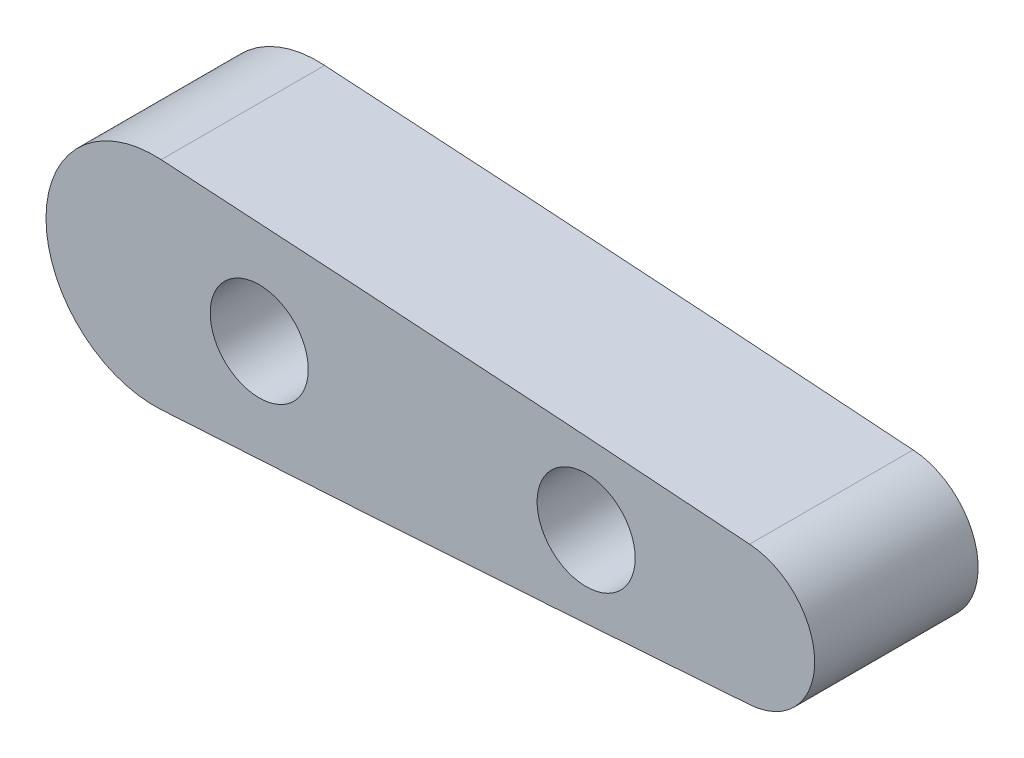
ISO-10303-21;
HEADER;
FILE_DESCRIPTION(('STEP AP214'),'2;1');
FILE_NAME('part.step','',(''),(''),'','','');
FILE_SCHEMA(('AUTOMOTIVE_DESIGN { 1 0 10303 214 1 1 1 1 }'));
ENDSEC;
DATA;
#1=APPLICATION_CONTEXT('core data for automotive mechanical design processes');
#2=APPLICATION_PROTOCOL_DEFINITION('international standard','automotive_design',2000,#1);
#3=PRODUCT_CONTEXT('',#1,'mechanical');
#4=PRODUCT('Part','Part','',(#3));
#5=PRODUCT_RELATED_PRODUCT_CATEGORY('part','',(#4));
#6=PRODUCT_DEFINITION_FORMATION('','',#4);
#7=PRODUCT_DEFINITION_CONTEXT('part definition',#1,'design');
#8=PRODUCT_DEFINITION('design','',#6,#7);
#9=PRODUCT_DEFINITION_SHAPE('','',#8);
#10=(LENGTH_UNIT() NAMED_UNIT(*) SI_UNIT(.MILLI.,.METRE.));
#11=(NAMED_UNIT(*) PLANE_ANGLE_UNIT() SI_UNIT($,.RADIAN.));
#12=(NAMED_UNIT(*) SI_UNIT($,.STERADIAN.) SOLID_ANGLE_UNIT());
#13=UNCERTAINTY_MEASURE_WITH_UNIT(LENGTH_MEASURE(1.E-05),#10,'distance_accuracy_value','');
#14=(GEOMETRIC_REPRESENTATION_CONTEXT(3) GLOBAL_UNCERTAINTY_ASSIGNED_CONTEXT((#13)) GLOBAL_UNIT_ASSIGNED_CONTEXT((#10,
#11,#12)) REPRESENTATION_CONTEXT('',''));
#15=CARTESIAN_POINT('',(0.,0.,0.));
#16=DIRECTION('',(0.,0.,1.));
#17=DIRECTION('',(1.,0.,0.));
#18=AXIS2_PLACEMENT_3D('',#15,#16,#17);
#19=CARTESIAN_POINT('',(106.499999999986,2.08799721122081,-82.8566204933771));
#20=CARTESIAN_POINT('',(104.913139889866,2.20366666564661,-82.8566204933771));
#21=CARTESIAN_POINT('',(102.105909691164,2.40304973466525,-82.8566204933771));
#22=CARTESIAN_POINT('',(98.0776680138944,2.67654836965966,-82.8566204933771));
#23=CARTESIAN_POINT('',(94.4157189816286,2.91456727593299,-82.8566204933771));
#24=CARTESIAN_POINT('',(91.2230954471117,3.11281194720779,-82.8566204933771));
#25=CARTESIAN_POINT('',(89.251038129504,3.23017110293967,-82.8566204933771));
#26=CARTESIAN_POINT('',(88.5,3.2740978712495,-82.8566204933771));
#27=B_SPLINE_CURVE_WITH_KNOTS('',3,(#19,#20,#21,#22,#23,#24,#25,#26),.UNSPECIFIED.,.F.,.F.,(4,1,
1,1,1,4),(0.104547089861926,0.124845726031854,0.140451441785836,0.156057157539818,
0.1716628732938,0.181260887125618),.UNSPECIFIED.);
#28=DIRECTION('',(0.,0.,1.));
#29=VECTOR('',#28,1.);
#30=SURFACE_OF_LINEAR_EXTRUSION('',#27,#29);
#31=CARTESIAN_POINT('',(87.6352127081631,3.32433643264375,-77.8566204933771));
#32=CARTESIAN_POINT('',(88.4113691729223,3.27955889680447,-77.8566204933771));
#33=CARTESIAN_POINT('',(89.1874771905029,3.2339446716543,-77.8566204933771));
#34=CARTESIAN_POINT('',(90.7396110024664,3.14112250056433,-77.8566204933771));
#35=CARTESIAN_POINT('',(91.5156367952523,3.09391452791605,-77.8566204933771));
#36=CARTESIAN_POINT('',(93.0676058131194,2.99798534597182,-77.8566204933771));
#37=CARTESIAN_POINT('',(93.8435490368727,2.94926411521234,-77.8566204933771));
#38=CARTESIAN_POINT('',(95.3953535002449,2.85040050042229,-77.8566204933771));
#39=CARTESIAN_POINT('',(96.1712147388674,2.80025810075456,-77.8566204933771));
#40=CARTESIAN_POINT('',(97.7228493922622,2.69854420049165,-77.8566204933771));
#41=CARTESIAN_POINT('',(98.4986228063312,2.64697268916497,-77.8566204933771));
#42=CARTESIAN_POINT('',(100.050078337508,2.5424311821218,-77.8566204933771));
#43=CARTESIAN_POINT('',(100.825760454256,2.48946118105995,-77.8566204933771));
#44=CARTESIAN_POINT('',(102.384771855159,2.38165151910941,-77.8566204933771));
#45=CARTESIAN_POINT('',(103.168100213863,2.32679847630783,-77.8566204933771));
#46=CARTESIAN_POINT('',(104.734655312807,2.21569654681215,-77.8566204933771));
#47=CARTESIAN_POINT('',(105.51788205338,2.15944766481633,-77.8566204933771));
#48=CARTESIAN_POINT('',(107.084225786503,2.04551889573925,-77.8566204933771));
#49=CARTESIAN_POINT('',(107.867342779806,1.98783901900712,-77.8566204933771));
#50=CARTESIAN_POINT('',(109.433458207299,1.87100445333641,-77.8566204933771));
#51=CARTESIAN_POINT('',(110.216456642682,1.81184978040082,-77.8566204933771));
#52=CARTESIAN_POINT('',(111.782332570815,1.69210843207474,-77.8566204933771));
#53=CARTESIAN_POINT('',(112.56521006515,1.63152177741547,-77.8566204933771));
#54=CARTESIAN_POINT('',(114.130842701712,1.50897098243555,-77.8566204933771));
#55=CARTESIAN_POINT('',(114.913597845928,1.44700686753738,-77.8566204933771));
#56=CARTESIAN_POINT('',(116.164867444712,1.34689890963801,-77.8566204933771));
#57=CARTESIAN_POINT('',(116.633415626266,1.30917602280913,-77.8566204933771));
#58=CARTESIAN_POINT('',(117.570474399654,1.23324167881202,-77.8566204933771));
#59=CARTESIAN_POINT('',(118.038984991323,1.19503021960084,-77.8566204933771));
#60=CARTESIAN_POINT('',(118.975971576497,1.11806305214027,-77.8566204933771));
#61=CARTESIAN_POINT('',(119.444447569047,1.07930733226494,-77.8566204933771));
#62=CARTESIAN_POINT('',(120.381368525974,1.00120300265298,-77.8566204933771));
#63=CARTESIAN_POINT('',(120.84981348843,0.961854369876036,-77.8566204933771));
#64=CARTESIAN_POINT('',(121.786676104761,0.882517214943915,-77.8566204933771));
#65=CARTESIAN_POINT('',(122.255093755564,0.842528656493359,-77.8566204933771));
#66=CARTESIAN_POINT('',(123.189299435001,0.762075055569229,-77.8566204933771));
#67=CARTESIAN_POINT('',(123.655087792259,0.721613830551957,-77.8566204933771));
#68=CARTESIAN_POINT('',(124.586605281054,0.64000019623207,-77.8566204933771));
#69=CARTESIAN_POINT('',(125.052334412414,0.598847784912287,-77.8566204933771));
#70=CARTESIAN_POINT('',(125.983712552323,0.515993719899053,-77.8566204933771));
#71=CARTESIAN_POINT('',(126.449361564142,0.4742921028995,-77.856620493377));
#72=CARTESIAN_POINT('',(127.380556671076,0.390459184577927,-77.8566204933771));
#73=CARTESIAN_POINT('',(127.846102771557,0.348327942802479,-77.8566204933771));
#74=CARTESIAN_POINT('',(128.777069788621,0.263761425536609,-77.856620493377));
#75=CARTESIAN_POINT('',(129.242490711113,0.221326215046723,-77.8566204933769));
#76=CARTESIAN_POINT('',(129.756272957071,0.174374739895032,-77.856620493377));
#77=CARTESIAN_POINT('',(129.804642972551,0.169953448832727,-77.8566204933771));
#78=CARTESIAN_POINT('',(129.901395564569,0.161107765702712,-77.8566204933771));
#79=CARTESIAN_POINT('',(129.949778141061,0.156683373124985,-77.8566204933771));
#80=CARTESIAN_POINT('',(130.04656998813,0.147830329438887,-77.8566204933771));
#81=CARTESIAN_POINT('',(130.094979258614,0.143401677329945,-77.8566204933771));
#82=CARTESIAN_POINT('',(130.192305753833,0.134496213348983,-77.8566204933771));
#83=CARTESIAN_POINT('',(130.241222976957,0.13001938388268,-77.8566204933771));
#84=CARTESIAN_POINT('',(130.339030174641,0.12106664391399,-77.8566204933771));
#85=CARTESIAN_POINT('',(130.387920149281,0.11659073427696,-77.8566204933771));
#86=CARTESIAN_POINT('',(130.485603991061,0.107646283059269,-77.8566204933771));
#87=CARTESIAN_POINT('',(130.534397858456,0.103177744263816,-77.8566204933771));
#88=CARTESIAN_POINT('',(130.607719889356,0.096461952301136,-77.8566204933771));
#89=CARTESIAN_POINT('',(130.632248096482,0.0942151754166717,-77.8566204933771));
#90=CARTESIAN_POINT('',(130.681352790301,0.0897168915093989,-77.8566204933771));
#91=CARTESIAN_POINT('',(130.705929276938,0.087465383885545,-77.8566204933771));
#92=CARTESIAN_POINT('',(130.742861332981,0.0840817376896126,-77.8566204933771));
#93=CARTESIAN_POINT('',(130.755216912161,0.082949706060125,-77.8566204933771));
#94=CARTESIAN_POINT('',(130.77993176734,0.0806852307678935,-77.8566204933771));
#95=CARTESIAN_POINT('',(130.792291043336,0.0795527870833553,-77.8566204933771));
#96=CARTESIAN_POINT('',(130.816784763394,0.0773084406667873,-77.8566204933771));
#97=CARTESIAN_POINT('',(130.828919207549,0.0761965390127487,-77.8566204933771));
#98=CARTESIAN_POINT('',(130.853174610258,0.0739738761859802,-77.8566204933771));
#99=CARTESIAN_POINT('',(130.865295568823,0.0728631151180098,-77.8566204933771));
#100=CARTESIAN_POINT('',(130.889457279055,0.0706489969916039,-77.8566204933771));
#101=CARTESIAN_POINT('',(130.901498030661,0.0695456395821775,-77.8566204933771));
#102=CARTESIAN_POINT('',(130.925629297512,0.0673338763497259,-77.8566204933771));
#103=CARTESIAN_POINT('',(130.937719812508,0.0662254685289059,-77.8566204933771));
#104=CARTESIAN_POINT('',(130.955761755344,0.064572616562242,-77.8566204933771));
#105=CARTESIAN_POINT('',(130.9617131074,0.0640275914370348,-77.8566204933771));
#106=CARTESIAN_POINT('',(130.970648643818,0.0632076492921179,-77.8566204933771));
#107=CARTESIAN_POINT('',(130.973632931343,0.0629335330764907,-77.8566204933771));
#108=CARTESIAN_POINT('',(130.979602102991,0.0623882866792282,-77.8566204933771));
#109=CARTESIAN_POINT('',(130.982586987142,0.0621171567076829,-77.8566204933771));
#110=CARTESIAN_POINT('',(130.988531736645,0.061565576637268,-77.8566204933771));
#111=CARTESIAN_POINT('',(130.991491613658,0.0612852169042784,-77.8566204933771));
#112=CARTESIAN_POINT('',(130.997416338375,0.0607670125634395,-77.8566204933771));
#113=CARTESIAN_POINT('',(131.000381185134,0.0605291606366496,-77.8566204933771));
#114=CARTESIAN_POINT('',(131.006262068579,0.0597785750068004,-77.8566204933771));
#115=CARTESIAN_POINT('',(131.009178288542,0.0592674420166957,-77.8566204933771));
#116=CARTESIAN_POINT('',(131.014949811945,0.0579826346009857,-77.8566204933771));
#117=CARTESIAN_POINT('',(131.017805140894,0.0572090725074948,-77.8566204933771));
#118=CARTESIAN_POINT('',(131.023260753326,0.0554665686276761,-77.8566204933771));
#119=CARTESIAN_POINT('',(131.025865865537,0.0545127380482153,-77.8566204933771));
#120=CARTESIAN_POINT('',(131.030986598708,0.052393606269711,-77.8566204933771));
#121=CARTESIAN_POINT('',(131.033502273756,0.0512284355728216,-77.8566204933771));
#122=CARTESIAN_POINT('',(131.038411272191,0.0487036662918271,-77.8566204933771));
#123=CARTESIAN_POINT('',(131.040805352605,0.0473455439926467,-77.8566204933771));
#124=CARTESIAN_POINT('',(131.045475348561,0.0444358333725833,-77.8566204933771));
#125=CARTESIAN_POINT('',(131.047751132229,0.0428840354300045,-77.8566204933771));
#126=CARTESIAN_POINT('',(131.054380236252,0.0379446163157709,-77.8566204933771));
#127=CARTESIAN_POINT('',(131.058531168236,0.034275093117848,-77.8566204933771));
#128=CARTESIAN_POINT('',(131.066141679201,0.0262496810953966,-77.8566204933771));
#129=CARTESIAN_POINT('',(131.069597129819,0.0218899531856247,-77.856620493377));
#130=CARTESIAN_POINT('',(131.078606109933,0.00827989650091442,-77.856620493377));
#131=CARTESIAN_POINT('',(131.083087135824,-0.00172175235987222,-77.856620493377));
#132=CARTESIAN_POINT('',(131.087324364228,-0.0175658201654442,-77.8566204933771));
#133=CARTESIAN_POINT('',(131.088314805616,-0.0231157901516927,-77.8566204933771));
#134=CARTESIAN_POINT('',(131.089305822654,-0.034307241890818,-77.8566204933771));
#135=CARTESIAN_POINT('',(131.089306253804,-0.0399487368822687,-77.8566204933771));
#136=CARTESIAN_POINT('',(131.087850064045,-0.0563240335140414,-77.8566204933771));
#137=CARTESIAN_POINT('',(131.085053174092,-0.0669699125515265,-77.8566204933771));
#138=CARTESIAN_POINT('',(131.078430698909,-0.0819870126706985,-77.8566204933771));
#139=CARTESIAN_POINT('',(131.075749667412,-0.086910462122504,-77.8566204933771));
#140=CARTESIAN_POINT('',(131.069578292076,-0.0962443066773445,-77.8566204933771));
#141=CARTESIAN_POINT('',(131.066087038429,-0.100654116585533,-77.8566204933771));
#142=CARTESIAN_POINT('',(131.058444160648,-0.108701924915136,-77.8566204933771));
#143=CARTESIAN_POINT('',(131.054305613579,-0.112352433319664,-77.8566204933771));
#144=CARTESIAN_POINT('',(131.045498190916,-0.118899737933699,-77.8566204933771));
#145=CARTESIAN_POINT('',(131.04083176521,-0.121799826010109,-77.8566204933771));
#146=CARTESIAN_POINT('',(131.033525841595,-0.125552724981596,-77.8566204933771));
#147=CARTESIAN_POINT('',(131.031035792242,-0.12670534321463,-77.8566204933771));
#148=CARTESIAN_POINT('',(131.025972043352,-0.128802658869973,-77.8566204933771));
#149=CARTESIAN_POINT('',(131.023398445285,-0.129747598422218,-77.8566204933771));
#150=CARTESIAN_POINT('',(131.018166556687,-0.131424547417404,-77.8566204933771));
#151=CARTESIAN_POINT('',(131.015507852355,-0.132155252358282,-77.8566204933771));
#152=CARTESIAN_POINT('',(131.010134771904,-0.133399362052631,-77.8566204933771));
#153=CARTESIAN_POINT('',(131.007420329589,-0.133912490634427,-77.8566204933771));
#154=CARTESIAN_POINT('',(131.001987317888,-0.134665430860083,-77.8566204933771));
#155=CARTESIAN_POINT('',(130.99926913116,-0.134908222846938,-77.8566204933771));
#156=CARTESIAN_POINT('',(130.993833714496,-0.135401760184937,-77.8566204933771));
#157=CARTESIAN_POINT('',(130.991116486543,-0.135652510954012,-77.8566204933771));
#158=CARTESIAN_POINT('',(130.985679328137,-0.13615210324926,-77.8566204933771));
#159=CARTESIAN_POINT('',(130.982959397138,-0.136400943285077,-77.8566204933771));
#160=CARTESIAN_POINT('',(130.977520374072,-0.136899108967222,-77.8566204933771));
#161=CARTESIAN_POINT('',(130.974801281957,-0.137148434485704,-77.8566204933771));
#162=CARTESIAN_POINT('',(130.96663842178,-0.137896764023474,-77.8566204933771));
#163=CARTESIAN_POINT('',(130.961194598434,-0.138395613764917,-77.8566204933771));
#164=CARTESIAN_POINT('',(130.950308584794,-0.139393260306135,-77.8566204933771));
#165=CARTESIAN_POINT('',(130.944866394488,-0.139892057078564,-77.8566204933771));
#166=CARTESIAN_POINT('',(130.928528311108,-0.141389455352178,-77.8566204933771));
#167=CARTESIAN_POINT('',(130.917632405934,-0.142388010659338,-77.8566204933771));
#168=CARTESIAN_POINT('',(130.89584506275,-0.144384683608581,-77.8566204933771));
#169=CARTESIAN_POINT('',(130.884953624739,-0.145382801262353,-77.8566204933771));
#170=CARTESIAN_POINT('',(130.83055884905,-0.150367538860962,-77.8566204933771));
#171=CARTESIAN_POINT('',(130.787055471281,-0.154353770627817,-77.8566204933771));
#172=CARTESIAN_POINT('',(130.700041987379,-0.162325960862708,-77.8566204933771));
#173=CARTESIAN_POINT('',(130.656531881235,-0.16631191919582,-77.8566204933771));
#174=CARTESIAN_POINT('',(130.569539440561,-0.174280289907403,-77.8566204933771));
#175=CARTESIAN_POINT('',(130.52605710609,-0.178262702922035,-77.8566204933771));
#176=CARTESIAN_POINT('',(130.439094384842,-0.186226253471414,-77.8566204933771));
#177=CARTESIAN_POINT('',(130.39561399807,-0.190207391057383,-77.8566204933771));
#178=CARTESIAN_POINT('',(130.236165022493,-0.204804612920256,-77.8566204933771));
#179=CARTESIAN_POINT('',(130.120196101281,-0.215417067570322,-77.8566204933771));
#180=CARTESIAN_POINT('',(129.888255180887,-0.23663185312723,-77.8566204933771));
#181=CARTESIAN_POINT('',(129.772283181687,-0.247234183844175,-77.8566204933771));
#182=CARTESIAN_POINT('',(129.540337479535,-0.268426706467263,-77.8566204933771));
#183=CARTESIAN_POINT('',(129.424363776577,-0.279016898311414,-77.8566204933771));
#184=CARTESIAN_POINT('',(129.192386697407,-0.300185805909083,-77.8566204933771));
#185=CARTESIAN_POINT('',(129.076383320881,-0.310764518218748,-77.8566204933771));
#186=CARTESIAN_POINT('',(128.84437571193,-0.331905942284446,-77.8566204933771));
#187=CARTESIAN_POINT('',(128.728371479513,-0.342468654122609,-77.8566204933771));
#188=CARTESIAN_POINT('',(128.496361620487,-0.363576227431325,-77.8566204933771));
#189=CARTESIAN_POINT('',(128.380355993879,-0.374121088936798,-77.8566204933771));
#190=CARTESIAN_POINT('',(127.800349009769,-0.42679389104308,-77.8566204933771));
#191=CARTESIAN_POINT('',(127.336334232571,-0.468774313461236,-77.8566204933771));
#192=CARTESIAN_POINT('',(126.408264368512,-0.552299127003516,-77.856620493377));
#193=CARTESIAN_POINT('',(125.944209281565,-0.593843517158748,-77.8566204933771));
#194=CARTESIAN_POINT('',(125.016049991942,-0.676380774606605,-77.8566204933771));
#195=CARTESIAN_POINT('',(124.551945789266,-0.717373641887072,-77.8566204933771));
#196=CARTESIAN_POINT('',(123.623733294743,-0.798665783864457,-77.8566204933771));
#197=CARTESIAN_POINT('',(123.159625010211,-0.83896514203178,-77.8566204933771));
#198=CARTESIAN_POINT('',(122.231349677223,-0.91888006116648,-77.8566204933771));
#199=CARTESIAN_POINT('',(121.767182628776,-0.958495622252568,-77.8566204933771));
#200=CARTESIAN_POINT('',(120.838795377736,-1.03710186157287,-77.8566204933771));
#201=CARTESIAN_POINT('',(120.37457517511,-1.0760925394307,-77.8566204933771));
#202=CARTESIAN_POINT('',(119.030136747137,-1.18816254828823,-77.8566204933771));
#203=CARTESIAN_POINT('',(118.149855310494,-1.26048403842724,-77.8566204933771));
#204=CARTESIAN_POINT('',(116.389151953123,-1.40339955595782,-77.8566204933771));
#205=CARTESIAN_POINT('',(115.508730032308,-1.47399358228056,-77.8566204933771));
#206=CARTESIAN_POINT('',(113.747749145328,-1.61349984411643,-77.8566204933771));
#207=CARTESIAN_POINT('',(112.867190178608,-1.68241207263175,-77.8566204933771));
#208=CARTESIAN_POINT('',(111.105934825034,-1.81845125372624,-77.8566204933771));
#209=CARTESIAN_POINT('',(110.225238438237,-1.88557820703817,-77.8566204933771));
#210=CARTESIAN_POINT('',(107.582932433601,-2.0841592264683,-77.8566204933771));
#211=CARTESIAN_POINT('',(105.821111327936,-2.2128130266798,-77.8566204933771));
#212=CARTESIAN_POINT('',(103.177950074108,-2.40049041468983,-77.8566204933771));
#213=CARTESIAN_POINT('',(102.29679706596,-2.46216751087174,-77.8566204933771));
#214=CARTESIAN_POINT('',(100.534371941976,-2.58379584405084,-77.8566204933771));
#215=CARTESIAN_POINT('',(99.6530998261586,-2.6437470812979,-77.8566204933771));
#216=CARTESIAN_POINT('',(97.0091066997536,-2.82087830987989,-77.8566204933771));
#217=CARTESIAN_POINT('',(95.2462027062994,-2.93533625935014,-77.856620493377));
#218=CARTESIAN_POINT('',(91.7199302625797,-3.15673382626463,-77.8566204933771));
#219=CARTESIAN_POINT('',(89.9565618148318,-3.26367348365341,-77.8566204933771));
#220=CARTESIAN_POINT('',(88.0070376080517,-3.37715699919156,-77.8566204933771));
#221=CARTESIAN_POINT('',(87.8211265390413,-3.38793134850724,-77.856620493377));
#222=CARTESIAN_POINT('',(87.6352127081651,-3.39865755249773,-77.856620493377));
#223=B_SPLINE_CURVE_WITH_KNOTS('',3,(#31,#32,#33,#34,#35,#36,#37,#38,#39,#40,#41,#42,#43,#44,
#45,#46,#47,#48,#49,#50,#51,#52,#53,#54,#55,#56,#57,#58,#59,#60,#61,#62,#63,#64,#65,#66,#67,#68,
#69,#70,#71,#72,#73,#74,#75,#76,#77,#78,#79,#80,#81,#82,#83,#84,#85,#86,#87,#88,#89,#90,#91,#92,
#93,#94,#95,#96,#97,#98,#99,#100,#101,#102,#103,#104,#105,#106,#107,#108,#109,#110,#111,#112,
#113,#114,#115,#116,#117,#118,#119,#120,#121,#122,#123,#124,#125,#126,#127,#128,#129,#130,#131,
#132,#133,#134,#135,#136,#137,#138,#139,#140,#141,#142,#143,#144,#145,#146,#147,#148,#149,#150,
#151,#152,#153,#154,#155,#156,#157,#158,#159,#160,#161,#162,#163,#164,#165,#166,#167,#168,#169,
#170,#171,#172,#173,#174,#175,#176,#177,#178,#179,#180,#181,#182,#183,#184,#185,#186,#187,#188,
#189,#190,#191,#192,#193,#194,#195,#196,#197,#198,#199,#200,#201,#202,#203,#204,#205,#206,#207,
#208,#209,#210,#211,#212,#213,#214,#215,#216,#217,#218,#219,#220,#221,#222),.UNSPECIFIED.,.F.,
.F.,(4,2,2,2,2,2,2,2,2,2,2,2,2,2,2,2,2,2,2,2,2,2,2,2,2,2,2,2,2,2,2,2,2,2,2,2,2,2,2,2,2,2,2,2,2,
2,2,2,2,2,2,2,2,2,2,2,2,2,2,2,2,2,2,2,2,2,2,2,2,2,2,2,2,2,2,2,2,2,2,2,2,2,2,2,2,2,2,2,2,2,2,2,2,
2,2,4),(0.,2.33234038472603,4.6647198749048,6.99713246189002,9.32957072243683,11.6620265024773,
13.9944911990042,16.3502297050013,18.7059602828474,21.061673828718,23.4173618239011,
25.7730157359771,28.1286262080166,29.5388188027181,30.9490172960054,32.3592459584978,
33.7695295638575,35.1798934433549,36.5825201260007,37.9851509028048,39.3876884367928,
40.7900341502524,42.1920884428957,42.33780342479,42.4835567801378,42.6293910485719,
42.7767560053057,42.9240393053747,43.0710334685428,43.1449261512597,43.2189643633087,
43.2561863526275,43.293419499169,43.3299753398682,43.3664905837768,43.4027641712252,
43.4391878561426,43.4571165793025,43.4661071960179,43.4750984412573,43.4840187775325,
43.4929375764327,43.5018046977834,43.5106680283642,43.5189810995335,43.5272890547644,
43.5355365635425,43.5437930775747,43.5603199053815,43.5769421167133,43.6091568876951,
43.6260008060988,43.6428471829948,43.6751854806681,43.6919459412092,43.7087253141055,
43.7252013943515,43.7416039244516,43.7498282018876,43.7580428392697,43.7663065045107,
43.7745806277245,43.7827626002268,43.7909502673842,43.7991437780961,43.80733536354,
43.8237351901663,43.8401302094079,43.8729548937009,43.9057661287113,44.036823000687,
44.1678999064696,44.2988928723216,44.4298796710399,44.7792401346799,45.1286070274863,
45.4779756965401,45.8274298882358,46.176882280083,46.5263339875066,47.924063632828,
49.3217963833323,50.7195291646453,52.1170925220438,53.5146556368128,54.9122195933253,
57.5619592203085,60.2117004866945,62.8614527765516,65.5112039788254,70.8107225030927,
73.4606480817436,76.1105732767035,81.4104050079996,86.7102085792554,87.268877608375),.UNSPECIFIED.);
#224=CARTESIAN_POINT('',(88.5,3.2740978712495,-77.8566204933771));
#225=VERTEX_POINT('',#224);
#226=CARTESIAN_POINT('',(106.499999999986,2.08799721122081,-77.8566204933771));
#227=VERTEX_POINT('',#226);
#228=EDGE_CURVE('E121',#225,#227,#223,.T.);
#229=ORIENTED_EDGE('',*,*,#228,.T.);
#230=DIRECTION('',(0.,0.,1.));
#231=VECTOR('',#230,1.);
#232=CARTESIAN_POINT('',(106.499999999986,2.08799721122082,-82.8566204933771));
#233=LINE('',#232,#231);
#234=CARTESIAN_POINT('',(106.499999995601,2.08541738374777,-82.856620493377));
#235=VERTEX_POINT('',#234);
#236=EDGE_CURVE('E97',#235,#227,#233,.T.);
#237=ORIENTED_EDGE('',*,*,#236,.F.);
#238=CARTESIAN_POINT('',(80.5323622932245,-3.77681744793102,-82.8566204933771));
#239=CARTESIAN_POINT('',(81.6170474200835,-3.72229594083059,-82.8566204933771));
#240=CARTESIAN_POINT('',(82.7016372216641,-3.66589517634506,-82.8566204933771));
#241=CARTESIAN_POINT('',(84.8706251874706,-3.54955583022335,-82.8566204933771));
#242=CARTESIAN_POINT('',(85.9550233520446,-3.48961725508404,-82.8566204933771));
#243=CARTESIAN_POINT('',(88.1236285555021,-3.3664229245953,-82.8566204933771));
#244=CARTESIAN_POINT('',(89.207835594818,-3.30316717684925,-82.8566204933771));
#245=CARTESIAN_POINT('',(91.3760614376003,-3.17350895446845,-82.8566204933771));
#246=CARTESIAN_POINT('',(92.4600802409797,-3.10710647838285,-82.8566204933771));
#247=CARTESIAN_POINT('',(95.7108292628098,-2.90364504004667,-82.8566204933771));
#248=CARTESIAN_POINT('',(97.8772912941965,-2.76227256445582,-82.8566204933771));
#249=CARTESIAN_POINT('',(101.126428081206,-2.54206991593241,-82.8566204933771));
#250=CARTESIAN_POINT('',(102.209381257437,-2.46731168941167,-82.8566204933771));
#251=CARTESIAN_POINT('',(104.375102469279,-2.31515913474321,-82.8566204933771));
#252=CARTESIAN_POINT('',(105.457870504956,-2.2377648075296,-82.8566204933771));
#253=CARTESIAN_POINT('',(107.62323191312,-2.08019816808871,-82.8566204933771));
#254=CARTESIAN_POINT('',(108.70582528051,-2.00002578581073,-82.8566204933771));
#255=CARTESIAN_POINT('',(110.870797728022,-1.83685022557342,-82.8566204933771));
#256=CARTESIAN_POINT('',(111.953176808323,-1.75384704998664,-82.8566204933771));
#257=CARTESIAN_POINT('',(114.118033013582,-1.58514212415582,-82.8566204933771));
#258=CARTESIAN_POINT('',(115.200510079408,-1.49943961586875,-82.8566204933771));
#259=CARTESIAN_POINT('',(117.365262347146,-1.32552318148619,-82.8566204933771));
#260=CARTESIAN_POINT('',(118.447537549089,-1.23730925575955,-82.8566204933771));
#261=CARTESIAN_POINT('',(120.612006510961,-1.05779717838658,-82.8566204933771));
#262=CARTESIAN_POINT('',(121.694200230533,-0.966498538249867,-82.8566204933771));
#263=CARTESIAN_POINT('',(123.316912297953,-0.826764443702669,-82.8566204933771));
#264=CARTESIAN_POINT('',(123.857552053368,-0.779737096689194,-82.8566204933771));
#265=CARTESIAN_POINT('',(124.938750480211,-0.684765029737916,-82.8566204933771));
#266=CARTESIAN_POINT('',(125.479309151707,-0.636820310575132,-82.8566204933771));
#267=CARTESIAN_POINT('',(126.560067980189,-0.540263607952073,-82.8566204933771));
#268=CARTESIAN_POINT('',(127.100268171217,-0.49165200484077,-82.8566204933771));
#269=CARTESIAN_POINT('',(127.910996703702,-0.418310494685927,-82.8566204933771));
#270=CARTESIAN_POINT('',(128.181542340414,-0.393771485101294,-82.8566204933771));
#271=CARTESIAN_POINT('',(128.722621279333,-0.344590786858323,-82.8566204933771));
#272=CARTESIAN_POINT('',(128.993154581643,-0.319949099333199,-82.8566204933771));
#273=CARTESIAN_POINT('',(129.399156727203,-0.282908373760463,-82.8566204933771));
#274=CARTESIAN_POINT('',(129.53462827263,-0.270538932459391,-82.8566204933771));
#275=CARTESIAN_POINT('',(129.805574384041,-0.245782870495092,-82.8566204933771));
#276=CARTESIAN_POINT('',(129.941048949974,-0.233396249268661,-82.856620493377));
#277=CARTESIAN_POINT('',(130.211353252694,-0.208668154595603,-82.8566204933771));
#278=CARTESIAN_POINT('',(130.346182995446,-0.196326746207177,-82.8566204933771));
#279=CARTESIAN_POINT('',(130.61582589878,-0.171634721997775,-82.856620493377));
#280=CARTESIAN_POINT('',(130.750639059473,-0.159284107408974,-82.8566204933769));
#281=CARTESIAN_POINT('',(130.891561683117,-0.14636981790649,-82.856620493377));
#282=CARTESIAN_POINT('',(130.897671509704,-0.145809899516159,-82.8566204933771));
#283=CARTESIAN_POINT('',(130.909892874723,-0.144689882887147,-82.8566204933771));
#284=CARTESIAN_POINT('',(130.916004413156,-0.144129784642006,-82.8566204933771));
#285=CARTESIAN_POINT('',(130.928296247229,-0.143003301351762,-82.8566204933771));
#286=CARTESIAN_POINT('',(130.93447654274,-0.142436916481821,-82.8566204933771));
#287=CARTESIAN_POINT('',(130.946831874121,-0.141304500353685,-82.8566204933771));
#288=CARTESIAN_POINT('',(130.953006909959,-0.140738469208381,-82.8566204933771));
#289=CARTESIAN_POINT('',(130.965427901286,-0.139600315244811,-82.8566204933771));
#290=CARTESIAN_POINT('',(130.971673855128,-0.139028197285912,-82.8566204933771));
#291=CARTESIAN_POINT('',(130.9810518341,-0.138167977615976,-82.8566204933771));
#292=CARTESIAN_POINT('',(130.984183659335,-0.137880499500349,-82.8566204933771));
#293=CARTESIAN_POINT('',(130.990449093383,-0.137307572159421,-82.8566204933771));
#294=CARTESIAN_POINT('',(130.993582701604,-0.13702212475117,-82.8566204933771));
#295=CARTESIAN_POINT('',(130.999804210783,-0.13644706337306,-82.8566204933771));
#296=CARTESIAN_POINT('',(131.002892068693,-0.136157582224099,-82.8566204933771));
#297=CARTESIAN_POINT('',(131.009013321147,-0.135230238224989,-82.8566204933771));
#298=CARTESIAN_POINT('',(131.01204680176,-0.134592987652331,-82.8566204933771));
#299=CARTESIAN_POINT('',(131.018019732877,-0.133052236159172,-82.8566204933771));
#300=CARTESIAN_POINT('',(131.020959696235,-0.132150647808228,-82.8566204933771));
#301=CARTESIAN_POINT('',(131.026746096548,-0.130073787953355,-82.8566204933771));
#302=CARTESIAN_POINT('',(131.029592423165,-0.128898205902472,-82.8566204933771));
#303=CARTESIAN_POINT('',(131.034846353619,-0.126439083794127,-82.8566204933771));
#304=CARTESIAN_POINT('',(131.037266954591,-0.125183175967956,-82.8566204933771));
#305=CARTESIAN_POINT('',(131.042001064798,-0.122474047175148,-82.8566204933771));
#306=CARTESIAN_POINT('',(131.044314340168,-0.121020420178541,-82.8566204933771));
#307=CARTESIAN_POINT('',(131.051084250492,-0.116363205236689,-82.8566204933771));
#308=CARTESIAN_POINT('',(131.05534980403,-0.112873174454203,-82.8566204933771));
#309=CARTESIAN_POINT('',(131.063196664209,-0.105201320235006,-82.8566204933771));
#310=CARTESIAN_POINT('',(131.066778724852,-0.101020268721386,-82.8566204933771));
#311=CARTESIAN_POINT('',(131.073168188587,-0.0921216319898305,-82.856620493377));
#312=CARTESIAN_POINT('',(131.075976422796,-0.0874046301559865,-82.856620493377));
#313=CARTESIAN_POINT('',(131.083108339351,-0.0728078472049871,-82.856620493377));
#314=CARTESIAN_POINT('',(131.086292551353,-0.062325251800687,-82.856620493377));
#315=CARTESIAN_POINT('',(131.088389863371,-0.0461022494871494,-82.8566204933771));
#316=CARTESIAN_POINT('',(131.088619304151,-0.0405001227540932,-82.8566204933771));
#317=CARTESIAN_POINT('',(131.088077403831,-0.0293459081843245,-82.8566204933771));
#318=CARTESIAN_POINT('',(131.087306054818,-0.023793820743605,-82.8566204933771));
#319=CARTESIAN_POINT('',(131.083697922353,-0.0079210341831829,-82.8566204933771));
#320=CARTESIAN_POINT('',(131.079621650064,0.00215187732929856,-82.8566204933771));
#321=CARTESIAN_POINT('',(131.071164720655,0.0160625922910266,-82.8566204933771));
#322=CARTESIAN_POINT('',(131.067850423865,0.0205877184827209,-82.8566204933771));
#323=CARTESIAN_POINT('',(131.060467917112,0.0289684104261673,-82.856620493377));
#324=CARTESIAN_POINT('',(131.056401268388,0.0328253312783334,-82.856620493377));
#325=CARTESIAN_POINT('',(131.047848025651,0.0396384437460229,-82.856620493377));
#326=CARTESIAN_POINT('',(131.043385564888,0.0426251433382383,-82.8566204933771));
#327=CARTESIAN_POINT('',(131.036378023458,0.0465415373474989,-82.8566204933771));
#328=CARTESIAN_POINT('',(131.033987177439,0.0477540407452498,-82.8566204933771));
#329=CARTESIAN_POINT('',(131.029121282609,0.0499805025788408,-82.8566204933771));
#330=CARTESIAN_POINT('',(131.026646427406,0.050994885390244,-82.8566204933771));
#331=CARTESIAN_POINT('',(131.019286039522,0.0536686896427004,-82.8566204933771));
#332=CARTESIAN_POINT('',(131.014295627982,0.0550526127287425,-82.8566204933771));
#333=CARTESIAN_POINT('',(131.006685188582,0.0565175706959031,-82.8566204933771));
#334=CARTESIAN_POINT('',(131.004120189043,0.0569042873792652,-82.8566204933771));
#335=CARTESIAN_POINT('',(131.00025432272,0.0573224831313463,-82.8566204933771));
#336=CARTESIAN_POINT('',(130.998961878338,0.0574349201427883,-82.8566204933771));
#337=CARTESIAN_POINT('',(130.996377647372,0.0576671255104809,-82.8566204933771));
#338=CARTESIAN_POINT('',(130.9950858609,0.0577868948520803,-82.8566204933771));
#339=CARTESIAN_POINT('',(130.988578780587,0.0583881326882032,-82.8566204933771));
#340=CARTESIAN_POINT('',(130.983362778491,0.0588633710798337,-82.8566204933771));
#341=CARTESIAN_POINT('',(130.972944577806,0.0598161675909854,-82.8566204933771));
#342=CARTESIAN_POINT('',(130.967742378183,0.0602937166139404,-82.8566204933771));
#343=CARTESIAN_POINT('',(130.957232016276,0.0612575743319622,-82.8566204933771));
#344=CARTESIAN_POINT('',(130.951923851781,0.061743863544582,-82.8566204933771));
#345=CARTESIAN_POINT('',(130.941303838913,0.0627170261293512,-82.8566204933771));
#346=CARTESIAN_POINT('',(130.93599199056,0.0632038996722003,-82.8566204933771));
#347=CARTESIAN_POINT('',(130.92012568453,0.064658088913873,-82.8566204933771));
#348=CARTESIAN_POINT('',(130.909571217769,0.0656253214803364,-82.856620493377));
#349=CARTESIAN_POINT('',(130.871769368662,0.0690895254930162,-82.856620493377));
#350=CARTESIAN_POINT('',(130.844521983208,0.0715864442636817,-82.8566204933771));
#351=CARTESIAN_POINT('',(130.789961782304,0.0765858929992533,-82.8566204933771));
#352=CARTESIAN_POINT('',(130.762648966768,0.0790884220487186,-82.8566204933771));
#353=CARTESIAN_POINT('',(130.708005177557,0.0840947957370031,-82.8566204933771));
#354=CARTESIAN_POINT('',(130.680674203861,0.0865986401466736,-82.8566204933771));
#355=CARTESIAN_POINT('',(130.62635997374,0.0915740858133954,-82.8566204933771));
#356=CARTESIAN_POINT('',(130.599376717764,0.094045691967193,-82.8566204933771));
#357=CARTESIAN_POINT('',(130.545428080669,0.0989868666957851,-82.8566204933771));
#358=CARTESIAN_POINT('',(130.518462699573,0.101456435534073,-82.8566204933771));
#359=CARTESIAN_POINT('',(130.464539273585,0.106394476216639,-82.8566204933771));
#360=CARTESIAN_POINT('',(130.437581228703,0.108862948176217,-82.8566204933771));
#361=CARTESIAN_POINT('',(130.302387731874,0.121241109185691,-82.8566204933771));
#362=CARTESIAN_POINT('',(130.19415197184,0.131147433704848,-82.8566204933771));
#363=CARTESIAN_POINT('',(129.977650036342,0.150954070747115,-82.856620493377));
#364=CARTESIAN_POINT('',(129.86938386066,0.160854380883353,-82.8566204933771));
#365=CARTESIAN_POINT('',(129.652842302608,0.180645482565585,-82.8566204933771));
#366=CARTESIAN_POINT('',(129.544566920168,0.190536273326977,-82.8566204933771));
#367=CARTESIAN_POINT('',(129.327474917558,0.210355342916868,-82.8566204933771));
#368=CARTESIAN_POINT('',(129.218658291989,0.220283562607532,-82.8566204933771));
#369=CARTESIAN_POINT('',(129.00103212676,0.240125730211722,-82.8566204933771));
#370=CARTESIAN_POINT('',(128.892222587194,0.250039679158199,-82.8566204933771));
#371=CARTESIAN_POINT('',(128.674605541912,0.269852177915113,-82.8566204933771));
#372=CARTESIAN_POINT('',(128.565798036238,0.279750728198008,-82.8566204933771));
#373=CARTESIAN_POINT('',(128.02237944775,0.329145283989675,-82.8566204933771));
#374=CARTESIAN_POINT('',(127.587757040786,0.368516893097916,-82.8566204933771));
#375=CARTESIAN_POINT('',(126.718465431679,0.4468947949847,-82.856620493377));
#376=CARTESIAN_POINT('',(126.283796228491,0.485901076189723,-82.8566204933771));
#377=CARTESIAN_POINT('',(125.414412824045,0.563450331379712,-82.8566204933771));
#378=CARTESIAN_POINT('',(124.979698622443,0.601993301523583,-82.8566204933771));
#379=CARTESIAN_POINT('',(124.111148352614,0.678422063490147,-82.8566204933771));
#380=CARTESIAN_POINT('',(123.677312392542,0.71630908342881,-82.8566204933771));
#381=CARTESIAN_POINT('',(122.809590345769,0.79146144326472,-82.8566204933771));
#382=CARTESIAN_POINT('',(122.375704259524,0.828726788441877,-82.8566204933771));
#383=CARTESIAN_POINT('',(121.507885079078,0.90269079032353,-82.8566204933771));
#384=CARTESIAN_POINT('',(121.073951985015,0.939389448647226,-82.8566204933771));
#385=CARTESIAN_POINT('',(119.337159068128,1.08520012456484,-82.8566204933771));
#386=CARTESIAN_POINT('',(118.034119841668,1.19217761321104,-82.8566204933771));
#387=CARTESIAN_POINT('',(115.427736575378,1.4024555912195,-82.8566204933771));
#388=CARTESIAN_POINT('',(114.124392533479,1.50575605484459,-82.8566204933771));
#389=CARTESIAN_POINT('',(111.517396015865,1.70847306963003,-82.8566204933771));
#390=CARTESIAN_POINT('',(110.213743538809,1.80788960358509,-82.8566204933771));
#391=CARTESIAN_POINT('',(107.606126805546,2.00258801934722,-82.8566204933771));
#392=CARTESIAN_POINT('',(106.3021625486,2.09786989124848,-82.8566204933771));
#393=CARTESIAN_POINT('',(103.69288674483,2.28459817095771,-82.8566204933771));
#394=CARTESIAN_POINT('',(102.387574968932,2.37604137509358,-82.8566204933771));
#395=CARTESIAN_POINT('',(99.7766898341519,2.5550645973452,-82.8566204933771));
#396=CARTESIAN_POINT('',(98.4711164759687,2.64264462564824,-82.8566204933771));
#397=CARTESIAN_POINT('',(95.8597079900711,2.81374032359384,-82.8566204933771));
#398=CARTESIAN_POINT('',(94.5538728632893,2.89725600746459,-82.8566204933771));
#399=CARTESIAN_POINT('',(91.9419438644466,3.06008141808794,-82.8566204933771));
#400=CARTESIAN_POINT('',(90.6358499932039,3.1393911579333,-82.8566204933771));
#401=CARTESIAN_POINT('',(88.5965494122729,3.25957423755559,-82.8566204933771));
#402=CARTESIAN_POINT('',(87.8634365171718,3.30204305174993,-82.8566204933771));
#403=CARTESIAN_POINT('',(86.3971249796831,3.38546705554496,-82.8566204933771));
#404=CARTESIAN_POINT('',(85.6639263373498,3.42642224609787,-82.8566204933771));
#405=CARTESIAN_POINT('',(84.1977177418369,3.50673576541759,-82.8566204933771));
#406=CARTESIAN_POINT('',(83.4647078212141,3.54609468815379,-82.8566204933771));
#407=CARTESIAN_POINT('',(81.9986004841087,3.62316322244633,-82.8566204933771));
#408=CARTESIAN_POINT('',(81.2655030675292,3.66087283215676,-82.8566204933771));
#409=CARTESIAN_POINT('',(80.5323622931298,3.69772338010481,-82.856620493377));
#410=B_SPLINE_CURVE_WITH_KNOTS('',3,(#238,#239,#240,#241,#242,#243,#244,#245,#246,#247,#248,
#249,#250,#251,#252,#253,#254,#255,#256,#257,#258,#259,#260,#261,#262,#263,#264,#265,#266,#267,
#268,#269,#270,#271,#272,#273,#274,#275,#276,#277,#278,#279,#280,#281,#282,#283,#284,#285,#286,
#287,#288,#289,#290,#291,#292,#293,#294,#295,#296,#297,#298,#299,#300,#301,#302,#303,#304,#305,
#306,#307,#308,#309,#310,#311,#312,#313,#314,#315,#316,#317,#318,#319,#320,#321,#322,#323,#324,
#325,#326,#327,#328,#329,#330,#331,#332,#333,#334,#335,#336,#337,#338,#339,#340,#341,#342,#343,
#344,#345,#346,#347,#348,#349,#350,#351,#352,#353,#354,#355,#356,#357,#358,#359,#360,#361,#362,
#363,#364,#365,#366,#367,#368,#369,#370,#371,#372,#373,#374,#375,#376,#377,#378,#379,#380,#381,
#382,#383,#384,#385,#386,#387,#388,#389,#390,#391,#392,#393,#394,#395,#396,#397,#398,#399,#400,
#401,#402,#403,#404,#405,#406,#407,#408,#409),.UNSPECIFIED.,.F.,.F.,(4,2,2,2,2,2,2,2,2,2,2,2,2,
2,2,2,2,2,2,2,2,2,2,2,2,2,2,2,2,2,2,2,2,2,2,2,2,2,2,2,2,2,2,2,2,2,2,2,2,2,2,2,2,2,2,2,2,2,2,2,2,
2,2,2,2,2,2,2,2,2,2,2,2,2,2,2,2,2,2,2,2,2,2,2,2,4),(0.,3.25816063326231,6.51631528341051,
9.77446246580078,13.0326111504245,19.5457858488361,22.8023749460741,26.0589628893228,
29.3156330096459,32.5723004005531,35.8298906492325,39.0874804194609,42.3455884967252,
43.9736314158456,45.6016729596118,47.2288216803871,48.0437903393709,48.8587500275767,
49.2668552642116,49.6749742117294,50.0811543859734,50.4872875090337,50.5056937977918,
50.524105240338,50.5427238530818,50.5613265110435,50.5801432498242,50.5895776703474,
50.5990196761074,50.6083155772418,50.6175951647082,50.6268092019026,50.6360337335967,
50.6442055122528,50.6523943329723,50.6688412267337,50.6852698707164,50.701680800344,
50.733872575103,50.7506162877708,50.7673601328263,50.7993079903371,50.8160648008505,
50.8327872208196,50.8488222589545,50.8568567607652,50.8648738591923,50.8803342177869,
50.8881081976926,50.8919997412695,50.895891808961,50.9116044437177,50.9272767103215,
50.9432678752232,50.9592702223803,50.9910663011263,51.0731509645887,51.1554326319512,
51.2377689074912,51.3190575564648,51.400292246915,51.4815047203308,51.8075691847146,
52.1337228726842,52.4599014668237,52.7877072744201,53.1154880238503,53.4432585097802,
54.7524645734347,56.0617119731464,57.3709702197411,58.6774312654106,59.9838812095994,
61.290327420166,65.2125892666985,69.1348785615257,73.0571852295976,76.9795012941932,
80.9050282770221,84.8305449075228,88.7560477948296,92.68153846164,94.8845629744459,
97.0875861012938,99.2897818206442,101.491980004624),.UNSPECIFIED.);
#411=CARTESIAN_POINT('',(88.5,3.26952259672796,-82.8566204933771));
#412=VERTEX_POINT('',#411);
#413=EDGE_CURVE('E115',#235,#412,#410,.T.);
#414=ORIENTED_EDGE('',*,*,#413,.T.);
#415=CARTESIAN_POINT('',(88.4999999999995,3.07669372321884,-173.));
#416=CARTESIAN_POINT('',(88.4999999999999,3.08151575774968,-170.984202030112));
#417=CARTESIAN_POINT('',(88.5,3.08628736524224,-168.968403939667));
#418=CARTESIAN_POINT('',(88.5000000000001,3.09573408875554,-164.936807532701));
#419=CARTESIAN_POINT('',(88.5,3.10040920477629,-162.921009216179));
#420=CARTESIAN_POINT('',(88.5,3.1073527821568,-159.897311583251));
#421=CARTESIAN_POINT('',(88.5,3.10965579184163,-158.889412346025));
#422=CARTESIAN_POINT('',(88.5000000000001,3.11653103590126,-155.865714557019));
#423=CARTESIAN_POINT('',(88.5,3.12106948528039,-153.849915928269));
#424=CARTESIAN_POINT('',(88.5,3.12781254068079,-150.82621784155));
#425=CARTESIAN_POINT('',(88.5,3.13004945603601,-149.818318455472));
#426=CARTESIAN_POINT('',(88.5,3.1345022094868,-147.802519636755));
#427=CARTESIAN_POINT('',(88.5,3.13671804758238,-146.794620204116));
#428=CARTESIAN_POINT('',(88.5000000000001,3.14333464331165,-143.77092183814));
#429=CARTESIAN_POINT('',(88.5000000000001,3.14770448238719,-141.755122837045));
#430=CARTESIAN_POINT('',(88.5,3.15419992695321,-138.731424208393));
#431=CARTESIAN_POINT('',(88.5,3.15635518946717,-137.72352464442));
#432=CARTESIAN_POINT('',(88.5,3.16064633435976,-135.707725475217));
#433=CARTESIAN_POINT('',(88.5,3.16278221673841,-134.699825869987));
#434=CARTESIAN_POINT('',(88.5000000000001,3.16916138470859,-131.676126993872));
#435=CARTESIAN_POINT('',(88.5,3.17337619113383,-129.660327662815));
#436=CARTESIAN_POINT('',(88.5,3.17964371094113,-126.636628553224));
#437=CARTESIAN_POINT('',(88.5,3.18172376923832,-125.628728831259));
#438=CARTESIAN_POINT('',(88.5,3.18793714510063,-122.605029610044));
#439=CARTESIAN_POINT('',(88.5,3.19204366363598,-120.589230055699));
#440=CARTESIAN_POINT('',(88.5,3.20426033270749,-114.541831182757));
#441=CARTESIAN_POINT('',(88.5,3.21226759670577,-110.510231655852));
#442=CARTESIAN_POINT('',(88.5,3.22408870573026,-104.462831996825));
#443=CARTESIAN_POINT('',(88.5,3.22799744424212,-102.447032049471));
#444=CARTESIAN_POINT('',(88.5,3.23575412823232,-98.4154320377901));
#445=CARTESIAN_POINT('',(88.5,3.23960207371066,-96.3996319734642));
#446=CARTESIAN_POINT('',(88.5000000000001,3.25105833539604,-90.3522316130725));
#447=CARTESIAN_POINT('',(88.5,3.25857907685119,-86.320631150755));
#448=CARTESIAN_POINT('',(88.5,3.2696978867831,-80.2732301605539));
#449=CARTESIAN_POINT('',(88.5,3.2733771063847,-78.2574297813462));
#450=CARTESIAN_POINT('',(88.5,3.28068335923066,-74.2258289283319));
#451=CARTESIAN_POINT('',(88.5,3.28431039247502,-72.2100284545253));
#452=CARTESIAN_POINT('',(88.5000000000001,3.29511600630489,-66.1626268971939));
#453=CARTESIAN_POINT('',(88.5000000000001,3.30221910098559,-62.1310256786287));
#454=CARTESIAN_POINT('',(88.5,3.31623749015563,-54.067822915374));
#455=CARTESIAN_POINT('',(88.5,3.32315278464496,-50.0362213706844));
#456=CARTESIAN_POINT('',(88.5,3.33339376044978,-43.9888188311126));
#457=CARTESIAN_POINT('',(88.5,3.33678542472952,-41.9730179477023));
#458=CARTESIAN_POINT('',(88.5,3.3468966613129,-35.9256151900085));
#459=CARTESIAN_POINT('',(88.5,3.35355247735961,-31.8940132088808));
#460=CARTESIAN_POINT('',(88.5,3.363417767237,-25.8466100449244));
#461=CARTESIAN_POINT('',(88.5,3.36668645816375,-23.8308089583943));
#462=CARTESIAN_POINT('',(88.5,3.37318578240981,-19.7992067239508));
#463=CARTESIAN_POINT('',(88.5000000000001,3.37641641572911,-17.7834055760373));
#464=CARTESIAN_POINT('',(88.5000000000001,3.3838136215796,-13.1414787956967));
#465=CARTESIAN_POINT('',(88.5,3.3879674171726,-10.5153531429094));
#466=CARTESIAN_POINT('',(88.5,3.39622143486873,-5.2594850080396));
#467=CARTESIAN_POINT('',(88.5,3.40032157531113,-2.62974252582891));
#468=CARTESIAN_POINT('',(88.5,3.40439348959486,0.));
#469=B_SPLINE_CURVE_WITH_KNOTS('',3,(#415,#416,#417,#418,#419,#420,#421,#422,#423,#424,#425,
#426,#427,#428,#429,#430,#431,#432,#433,#434,#435,#436,#437,#438,#439,#440,#441,#442,#443,#444,
#445,#446,#447,#448,#449,#450,#451,#452,#453,#454,#455,#456,#457,#458,#459,#460,#461,#462,#463,
#464,#465,#466,#467,#468),.UNSPECIFIED.,.F.,.F.,(4,2,2,2,2,2,2,2,2,2,2,2,2,2,2,2,2,2,2,2,2,2,2,
2,2,2,4),(0.,6.04741121133332,12.0948224225041,15.1185280274444,21.165939238402,
24.1896448433179,27.2133504482265,33.2607616589482,36.2844672638375,39.3081728687211,
45.3555840792572,48.3792896841249,54.4267008945412,66.5215233201669,72.5689345303839,
78.6163457405448,90.7111681643546,96.758579374378,102.805990584364,114.900813006949,
126.995635429076,133.04304663892,145.137869060464,151.185280270239,157.232691479993,
165.111078292866,173.000315327809),.UNSPECIFIED.);
#470=EDGE_CURVE('E12',#412,#225,#469,.T.);
#471=ORIENTED_EDGE('',*,*,#470,.T.);
#472=EDGE_LOOP('',(#229,#237,#414,#471));
#473=FACE_BOUND('',#472,.T.);
#474=ADVANCED_FACE('F71',(#473),#30,.T.);
#475=CARTESIAN_POINT('',(106.359963831374,-0.0371605599269986,-82.8566204933771));
#476=DIRECTION('',(0.,0.,1.));
#477=DIRECTION('',(1.,0.,0.));
#478=AXIS2_PLACEMENT_3D('',#475,#476,#477);
#479=CYLINDRICAL_SURFACE('',#478,2.12976657894466);
#480=CARTESIAN_POINT('',(106.359963831374,-0.0371605599269986,-77.8566204933771));
#481=DIRECTION('',(0.,0.,1.));
#482=DIRECTION('',(-1.,0.,0.));
#483=AXIS2_PLACEMENT_3D('',#480,#481,#482);
#484=CIRCLE('',#483,2.12976657894466);
#485=CARTESIAN_POINT('',(106.5,-2.16231833107391,-77.8566204933771));
#486=VERTEX_POINT('',#485);
#487=EDGE_CURVE('E89',#486,#227,#484,.T.);
#488=ORIENTED_EDGE('',*,*,#487,.F.);
#489=DIRECTION('',(0.,0.,1.));
#490=VECTOR('',#489,1.);
#491=CARTESIAN_POINT('',(106.5,-2.16231833107391,-82.8566204933771));
#492=LINE('',#491,#490);
#493=CARTESIAN_POINT('',(106.499999995607,-2.1621249775898,-82.856620493377));
#494=VERTEX_POINT('',#493);
#495=EDGE_CURVE('E112',#494,#486,#492,.T.);
#496=ORIENTED_EDGE('',*,*,#495,.F.);
#497=CARTESIAN_POINT('',(106.359963831374,-0.0371605599269986,-82.8566204933771));
#498=DIRECTION('',(0.,0.,1.));
#499=DIRECTION('',(-1.,0.,0.));
#500=AXIS2_PLACEMENT_3D('',#497,#498,#499);
#501=CIRCLE('',#500,2.12976657894466);
#502=EDGE_CURVE('E221',#494,#235,#501,.T.);
#503=ORIENTED_EDGE('',*,*,#502,.T.);
#504=ORIENTED_EDGE('',*,*,#236,.T.);
#505=EDGE_LOOP('',(#488,#496,#503,#504));
#506=FACE_BOUND('',#505,.T.);
#507=ADVANCED_FACE('F246',(#506),#479,.T.);
#508=CARTESIAN_POINT('',(88.5,-3.34841899110359,-82.8566204933771));
#509=CARTESIAN_POINT('',(89.251038129504,-3.30449222279377,-82.8566204933771));
#510=CARTESIAN_POINT('',(91.2230954471116,-3.18713306706189,-82.8566204933771));
#511=CARTESIAN_POINT('',(94.4157189816287,-2.98888839578708,-82.8566204933771));
#512=CARTESIAN_POINT('',(98.0776680138943,-2.75086948951376,-82.8566204933771));
#513=CARTESIAN_POINT('',(102.105909691168,-2.47737085451904,-82.8566204933771));
#514=CARTESIAN_POINT('',(104.913139889875,-2.27798778550006,-82.8566204933771));
#515=CARTESIAN_POINT('',(106.5,-2.16231833107391,-82.8566204933771));
#516=B_SPLINE_CURVE_WITH_KNOTS('',3,(#508,#509,#510,#511,#512,#513,#514,#515),.UNSPECIFIED.,.F.,
.F.,(4,1,1,1,1,4),(0.817504921129217,0.827102934961036,0.842708650715017,0.858314366468999,
0.873920082222981,0.894218718392968),.UNSPECIFIED.);
#517=DIRECTION('',(0.,0.,1.));
#518=VECTOR('',#517,1.);
#519=SURFACE_OF_LINEAR_EXTRUSION('',#516,#518);
#520=CARTESIAN_POINT('',(88.5,-3.34841899110359,-77.8566204933771));
#521=VERTEX_POINT('',#520);
#522=EDGE_CURVE('E125',#486,#521,#223,.T.);
#523=ORIENTED_EDGE('',*,*,#522,.T.);
#524=CARTESIAN_POINT('',(88.5000000000001,-3.40439348959485,0.));
#525=CARTESIAN_POINT('',(88.5,-3.40281969855824,-2.65028953769036));
#526=CARTESIAN_POINT('',(88.5,-3.40121723902684,-5.30057905843202));
#527=CARTESIAN_POINT('',(88.5,-3.39795194763906,-10.6011580627297));
#528=CARTESIAN_POINT('',(88.5,-3.39628911578268,-13.2514475462858));
#529=CARTESIAN_POINT('',(88.5,-3.39290004440956,-18.552026472909));
#530=CARTESIAN_POINT('',(88.5,-3.39117380489282,-21.2023159159761));
#531=CARTESIAN_POINT('',(88.5,-3.38765471914475,-26.5028947579345));
#532=CARTESIAN_POINT('',(88.5,-3.38586187291343,-29.1531841568259));
#533=CARTESIAN_POINT('',(88.5,-3.38220626935809,-34.4537629064464));
#534=CARTESIAN_POINT('',(88.5,-3.38034351203407,-37.1040522571756));
#535=CARTESIAN_POINT('',(88.5,-3.37654459222326,-42.40463090608));
#536=CARTESIAN_POINT('',(88.5,-3.37460842973646,-45.0549202042553));
#537=CARTESIAN_POINT('',(88.5,-3.37065935013665,-50.3554987434771));
#538=CARTESIAN_POINT('',(88.5,-3.36864643302364,-53.0057879845236));
#539=CARTESIAN_POINT('',(88.5,-3.36454049994691,-58.3063664046316));
#540=CARTESIAN_POINT('',(88.5,-3.36244748398319,-60.9566555836931));
#541=CARTESIAN_POINT('',(88.5,-3.3581776896225,-66.2572338744122));
#542=CARTESIAN_POINT('',(88.5,-3.35600091122552,-68.9075229860698));
#543=CARTESIAN_POINT('',(88.5,-3.35155964989256,-74.2081011359772));
#544=CARTESIAN_POINT('',(88.5,-3.34929516695658,-76.858390174227));
#545=CARTESIAN_POINT('',(88.5,-3.34467422693731,-82.1589681706352));
#546=CARTESIAN_POINT('',(88.5,-3.34231776985402,-84.8092571287936));
#547=CARTESIAN_POINT('',(88.5,-3.33750825295903,-90.1098349575565));
#548=CARTESIAN_POINT('',(88.5,-3.33505519314734,-92.760123828161));
#549=CARTESIAN_POINT('',(88.5000000000001,-3.33004744852443,-98.060701473484));
#550=CARTESIAN_POINT('',(88.5000000000001,-3.32749276371323,-100.710990248202));
#551=CARTESIAN_POINT('',(88.5,-3.32227626564496,-106.011567692314));
#552=CARTESIAN_POINT('',(88.5,-3.31961445238789,-108.661856361706));
#553=CARTESIAN_POINT('',(88.5,-3.31417785760184,-113.962433584883));
#554=CARTESIAN_POINT('',(88.5,-3.31140307607286,-116.612722138667));
#555=CARTESIAN_POINT('',(88.5000000000001,-3.3071515417753,-120.588154873311));
#556=CARTESIAN_POINT('',(88.5000000000001,-3.30571947000889,-121.913299102073));
#557=CARTESIAN_POINT('',(88.5000000000001,-3.30282472981652,-124.563587526213));
#558=CARTESIAN_POINT('',(88.5,-3.30136206139056,-125.88873172159));
#559=CARTESIAN_POINT('',(88.5,-3.29840530180975,-128.539020077294));
#560=CARTESIAN_POINT('',(88.5,-3.2969112106549,-129.86416423762));
#561=CARTESIAN_POINT('',(88.5000000000001,-3.29389075450708,-132.514452521505));
#562=CARTESIAN_POINT('',(88.5,-3.2923643895141,-133.839596645064));
#563=CARTESIAN_POINT('',(88.5,-3.28927851131764,-136.489884853598));
#564=CARTESIAN_POINT('',(88.5,-3.28771899811416,-137.815028938573));
#565=CARTESIAN_POINT('',(88.5000000000001,-3.28456592322259,-140.465317068028));
#566=CARTESIAN_POINT('',(88.5,-3.2829723615345,-141.790461112509));
#567=CARTESIAN_POINT('',(88.5,-3.2797502683857,-144.44074915897));
#568=CARTESIAN_POINT('',(88.5,-3.278121736925,-145.765893160951));
#569=CARTESIAN_POINT('',(88.5,-3.27482869705925,-148.416181120227));
#570=CARTESIAN_POINT('',(88.5,-3.27316418865421,-149.741325077522));
#571=CARTESIAN_POINT('',(88.5,-3.26979814147614,-152.391612945098));
#572=CARTESIAN_POINT('',(88.5,-3.26809660270311,-153.71675685538));
#573=CARTESIAN_POINT('',(88.5,-3.26465540044314,-156.367044626459));
#574=CARTESIAN_POINT('',(88.5,-3.26291573695621,-157.692188487256));
#575=CARTESIAN_POINT('',(88.5000000000001,-3.25939714398976,-160.342476156742));
#576=CARTESIAN_POINT('',(88.5000000000001,-3.25761821451024,-161.66761996543));
#577=CARTESIAN_POINT('',(88.5,-3.25401990700614,-164.317907527906));
#578=CARTESIAN_POINT('',(88.5,-3.25220052898155,-165.643051281694));
#579=CARTESIAN_POINT('',(88.5,-3.24756817328595,-168.978796739384));
#580=CARTESIAN_POINT('',(88.5,-3.24472804473776,-170.989398405601));
#581=CARTESIAN_POINT('',(88.5,-3.24183772321879,-173.));
#582=B_SPLINE_CURVE_WITH_KNOTS('',3,(#524,#525,#526,#527,#528,#529,#530,#531,#532,#533,#534,
#535,#536,#537,#538,#539,#540,#541,#542,#543,#544,#545,#546,#547,#548,#549,#550,#551,#552,#553,
#554,#555,#556,#557,#558,#559,#560,#561,#562,#563,#564,#565,#566,#567,#568,#569,#570,#571,#572,
#573,#574,#575,#576,#577,#578,#579,#580,#581),.UNSPECIFIED.,.F.,.F.,(4,2,2,2,2,2,2,2,2,2,2,2,2,
2,2,2,2,2,2,2,2,2,2,2,2,2,2,2,4),(0.,7.95087001484636,15.9017400297432,23.8526100446953,
31.8034800597079,39.7543500747865,47.7052200899366,55.6560901051581,63.6069601204578,
71.5578301358457,79.5087001513336,87.4595701669349,95.4104401826654,103.361310198544,
111.312180214591,119.263050230827,123.238485238265,127.213920245717,131.189355253183,
135.164790260665,139.140225268164,143.11566027568,147.091095283214,151.06653029077,
155.041965298347,159.017400305949,162.992835313576,166.968270321231,173.000081335629),.UNSPECIFIED.);
#583=CARTESIAN_POINT('',(88.5,-3.34623019057051,-82.8566204933629));
#584=VERTEX_POINT('',#583);
#585=EDGE_CURVE('E82',#521,#584,#582,.T.);
#586=ORIENTED_EDGE('',*,*,#585,.T.);
#587=EDGE_CURVE('E172',#584,#494,#410,.T.);
#588=ORIENTED_EDGE('',*,*,#587,.T.);
#589=ORIENTED_EDGE('',*,*,#495,.T.);
#590=EDGE_LOOP('',(#523,#586,#588,#589));
#591=FACE_BOUND('',#590,.T.);
#592=ADVANCED_FACE('F191',(#591),#519,.T.);
#593=CARTESIAN_POINT('',(58.6887937707036,10.,-82.8566204933771));
#594=DIRECTION('',(0.,0.,-1.));
#595=DIRECTION('',(-1.,0.,0.));
#596=AXIS2_PLACEMENT_3D('',#593,#594,#595);
#597=PLANE('',#596);
#598=CARTESIAN_POINT('',(101.5,-0.0371605599265449,-82.8566204933771));
#599=DIRECTION('',(0.,0.,1.));
#600=DIRECTION('',(1.,0.,0.));
#601=AXIS2_PLACEMENT_3D('',#598,#599,#600);
#602=CIRCLE('',#601,1.5);
#603=CARTESIAN_POINT('',(103.,-0.0371605599265449,-82.8566204933771));
#604=VERTEX_POINT('',#603);
#605=EDGE_CURVE('E268',#604,#604,#602,.T.);
#606=ORIENTED_EDGE('',*,*,#605,.T.);
#607=EDGE_LOOP('',(#606));
#608=FACE_BOUND('',#607,.T.);
#609=CARTESIAN_POINT('',(91.5,-0.0371605599265449,-82.8566204933771));
#610=DIRECTION('',(0.,0.,1.));
#611=DIRECTION('',(1.,0.,0.));
#612=AXIS2_PLACEMENT_3D('',#609,#610,#611);
#613=CIRCLE('',#612,1.5);
#614=CARTESIAN_POINT('',(93.,-0.0371605599265449,-82.8566204933771));
#615=VERTEX_POINT('',#614);
#616=EDGE_CURVE('E261',#615,#615,#613,.T.);
#617=ORIENTED_EDGE('',*,*,#616,.T.);
#618=EDGE_LOOP('',(#617));
#619=FACE_BOUND('',#618,.T.);
#620=ORIENTED_EDGE('',*,*,#413,.F.);
#621=ORIENTED_EDGE('',*,*,#502,.F.);
#622=ORIENTED_EDGE('',*,*,#587,.F.);
#623=CARTESIAN_POINT('',(88.2957153301807,-0.0371605599270497,-82.8566204933771));
#624=DIRECTION('',(0.,0.,1.));
#625=DIRECTION('',(1.,0.,0.));
#626=AXIS2_PLACEMENT_3D('',#623,#624,#625);
#627=CIRCLE('',#626,3.31755401227485);
#628=EDGE_CURVE('E137',#412,#584,#627,.T.);
#629=ORIENTED_EDGE('',*,*,#628,.F.);
#630=EDGE_LOOP('',(#620,#621,#622,#629));
#631=FACE_BOUND('',#630,.T.);
#632=ADVANCED_FACE('F188',(#608,#619,#631),#597,.T.);
#633=CARTESIAN_POINT('',(58.6887937707036,10.,-77.8566204933771));
#634=DIRECTION('',(0.,0.,1.));
#635=DIRECTION('',(1.,0.,0.));
#636=AXIS2_PLACEMENT_3D('',#633,#634,#635);
#637=PLANE('',#636);
#638=CARTESIAN_POINT('',(101.5,-0.0371605599265449,-77.8566204933771));
#639=DIRECTION('',(0.,0.,1.));
#640=DIRECTION('',(1.,0.,0.));
#641=AXIS2_PLACEMENT_3D('',#638,#639,#640);
#642=CIRCLE('',#641,1.5);
#643=CARTESIAN_POINT('',(103.,-0.0371605599265449,-77.8566204933771));
#644=VERTEX_POINT('',#643);
#645=EDGE_CURVE('E139',#644,#644,#642,.T.);
#646=ORIENTED_EDGE('',*,*,#645,.F.);
#647=EDGE_LOOP('',(#646));
#648=FACE_BOUND('',#647,.T.);
#649=CARTESIAN_POINT('',(91.5,-0.0371605599265449,-77.8566204933771));
#650=DIRECTION('',(0.,0.,1.));
#651=DIRECTION('',(1.,0.,0.));
#652=AXIS2_PLACEMENT_3D('',#649,#650,#651);
#653=CIRCLE('',#652,1.5);
#654=CARTESIAN_POINT('',(93.,-0.0371605599265449,-77.8566204933771));
#655=VERTEX_POINT('',#654);
#656=EDGE_CURVE('E263',#655,#655,#653,.T.);
#657=ORIENTED_EDGE('',*,*,#656,.F.);
#658=EDGE_LOOP('',(#657));
#659=FACE_BOUND('',#658,.T.);
#660=ORIENTED_EDGE('',*,*,#522,.F.);
#661=ORIENTED_EDGE('',*,*,#487,.T.);
#662=ORIENTED_EDGE('',*,*,#228,.F.);
#663=CARTESIAN_POINT('',(88.2957153301807,-0.0371605599270497,-77.8566204933771));
#664=DIRECTION('',(0.,0.,1.));
#665=DIRECTION('',(1.,0.,0.));
#666=AXIS2_PLACEMENT_3D('',#663,#664,#665);
#667=CIRCLE('',#666,3.31755401227485);
#668=EDGE_CURVE('E124',#225,#521,#667,.T.);
#669=ORIENTED_EDGE('',*,*,#668,.T.);
#670=EDGE_LOOP('',(#660,#661,#662,#669));
#671=FACE_BOUND('',#670,.T.);
#672=ADVANCED_FACE('F122',(#648,#659,#671),#637,.T.);
#673=CARTESIAN_POINT('',(91.5,-0.0371605599265449,-82.8566204933771));
#674=DIRECTION('',(0.,0.,1.));
#675=DIRECTION('',(1.,0.,0.));
#676=AXIS2_PLACEMENT_3D('',#673,#674,#675);
#677=CYLINDRICAL_SURFACE('',#676,1.5);
#678=ORIENTED_EDGE('',*,*,#616,.F.);
#679=EDGE_LOOP('',(#678));
#680=FACE_BOUND('',#679,.T.);
#681=ORIENTED_EDGE('',*,*,#656,.T.);
#682=EDGE_LOOP('',(#681));
#683=FACE_BOUND('',#682,.T.);
#684=ADVANCED_FACE('F279',(#680,#683),#677,.F.);
#685=CARTESIAN_POINT('',(101.5,-0.0371605599265449,-82.8566204933771));
#686=DIRECTION('',(0.,0.,1.));
#687=DIRECTION('',(1.,0.,0.));
#688=AXIS2_PLACEMENT_3D('',#685,#686,#687);
#689=CYLINDRICAL_SURFACE('',#688,1.5);
#690=ORIENTED_EDGE('',*,*,#605,.F.);
#691=EDGE_LOOP('',(#690));
#692=FACE_BOUND('',#691,.T.);
#693=ORIENTED_EDGE('',*,*,#645,.T.);
#694=EDGE_LOOP('',(#693));
#695=FACE_BOUND('',#694,.T.);
#696=ADVANCED_FACE('F160',(#692,#695),#689,.F.);
#697=CARTESIAN_POINT('',(88.2957153301807,-0.0371605599270497,-82.8566204933771));
#698=DIRECTION('',(0.,0.,1.));
#699=DIRECTION('',(1.,0.,0.));
#700=AXIS2_PLACEMENT_3D('',#697,#698,#699);
#701=CYLINDRICAL_SURFACE('',#700,3.31755401227485);
#702=ORIENTED_EDGE('',*,*,#668,.F.);
#703=ORIENTED_EDGE('',*,*,#470,.F.);
#704=ORIENTED_EDGE('',*,*,#628,.T.);
#705=ORIENTED_EDGE('',*,*,#585,.F.);
#706=EDGE_LOOP('',(#702,#703,#704,#705));
#707=FACE_BOUND('',#706,.T.);
#708=ADVANCED_FACE('F135',(#707),#701,.T.);
#709=CLOSED_SHELL('',(#474,#507,#592,#632,#672,#684,#696,#708));
#710=MANIFOLD_SOLID_BREP('B2',#709);
#711=ADVANCED_BREP_SHAPE_REPRESENTATION('',(#18,#710),#14);
#712=SHAPE_DEFINITION_REPRESENTATION(#9,#711);
ENDSEC;
END-ISO-10303-21;
